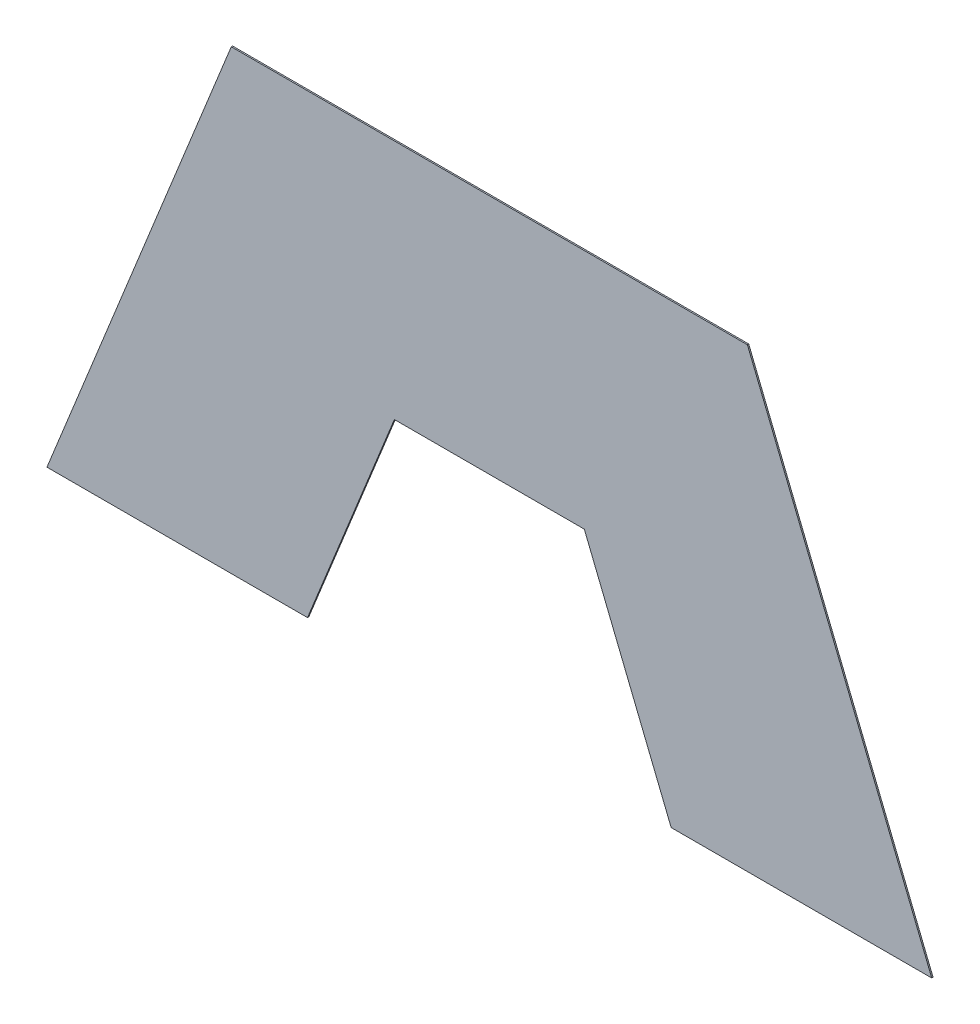
ISO-10303-21;
HEADER;
FILE_DESCRIPTION(('STEP AP214'),'2;1');
FILE_NAME('part.step','',(''),(''),'','','');
FILE_SCHEMA(('AUTOMOTIVE_DESIGN { 1 0 10303 214 1 1 1 1 }'));
ENDSEC;
DATA;
#1=APPLICATION_CONTEXT('core data for automotive mechanical design processes');
#2=APPLICATION_PROTOCOL_DEFINITION('international standard','automotive_design',2000,#1);
#3=PRODUCT_CONTEXT('',#1,'mechanical');
#4=PRODUCT('Part','Part','',(#3));
#5=PRODUCT_RELATED_PRODUCT_CATEGORY('part','',(#4));
#6=PRODUCT_DEFINITION_FORMATION('','',#4);
#7=PRODUCT_DEFINITION_CONTEXT('part definition',#1,'design');
#8=PRODUCT_DEFINITION('design','',#6,#7);
#9=PRODUCT_DEFINITION_SHAPE('','',#8);
#10=(LENGTH_UNIT() NAMED_UNIT(*) SI_UNIT(.MILLI.,.METRE.));
#11=(NAMED_UNIT(*) PLANE_ANGLE_UNIT() SI_UNIT($,.RADIAN.));
#12=(NAMED_UNIT(*) SI_UNIT($,.STERADIAN.) SOLID_ANGLE_UNIT());
#13=UNCERTAINTY_MEASURE_WITH_UNIT(LENGTH_MEASURE(1.E-05),#10,'distance_accuracy_value','');
#14=(GEOMETRIC_REPRESENTATION_CONTEXT(3) GLOBAL_UNCERTAINTY_ASSIGNED_CONTEXT((#13)) GLOBAL_UNIT_ASSIGNED_CONTEXT((#10,
#11,#12)) REPRESENTATION_CONTEXT('',''));
#15=CARTESIAN_POINT('',(0.,0.,0.));
#16=DIRECTION('',(0.,0.,1.));
#17=DIRECTION('',(1.,0.,0.));
#18=AXIS2_PLACEMENT_3D('',#15,#16,#17);
#19=CARTESIAN_POINT('',(0.40256545132415,-0.192580169588,0.0009));
#20=DIRECTION('',(0.,0.,-1.));
#21=DIRECTION('',(-1.,0.,0.));
#22=AXIS2_PLACEMENT_3D('',#19,#20,#21);
#23=PLANE('',#22);
#24=DIRECTION('',(-1.,0.,0.));
#25=VECTOR('',#24,1.);
#26=CARTESIAN_POINT('',(0.3888735877747,-0.192580169588,0.0009));
#27=LINE('',#26,#25);
#28=CARTESIAN_POINT('',(0.3888735877747,-0.192580169588,0.0009));
#29=VERTEX_POINT('',#28);
#30=CARTESIAN_POINT('',(0.3692535877747,-0.192580169588,0.0009));
#31=VERTEX_POINT('',#30);
#32=EDGE_CURVE('E11',#29,#31,#27,.T.);
#33=ORIENTED_EDGE('',*,*,#32,.T.);
#34=DIRECTION('',(0.374606593414237,0.927183854567464,0.));
#35=VECTOR('',#34,1.);
#36=CARTESIAN_POINT('',(0.3692535877747,-0.192580169588,0.0009));
#37=LINE('',#36,#35);
#38=CARTESIAN_POINT('',(0.3831340270567,-0.1582248768013,0.0009));
#39=VERTEX_POINT('',#38);
#40=EDGE_CURVE('E24',#31,#39,#37,.T.);
#41=ORIENTED_EDGE('',*,*,#40,.T.);
#42=DIRECTION('',(1.,0.,0.));
#43=VECTOR('',#42,1.);
#44=CARTESIAN_POINT('',(0.3831340270567,-0.1582248768013,0.0009));
#45=LINE('',#44,#43);
#46=CARTESIAN_POINT('',(0.4219968755916,-0.1582248768013,0.0009));
#47=VERTEX_POINT('',#46);
#48=EDGE_CURVE('E94',#39,#47,#45,.T.);
#49=ORIENTED_EDGE('',*,*,#48,.T.);
#50=DIRECTION('',(0.374606593414238,-0.927183854567464,0.));
#51=VECTOR('',#50,1.);
#52=CARTESIAN_POINT('',(0.4219968755916,-0.1582248768013,0.0009));
#53=LINE('',#52,#51);
#54=CARTESIAN_POINT('',(0.4358773148736,-0.192580169588,0.0009));
#55=VERTEX_POINT('',#54);
#56=EDGE_CURVE('E138',#47,#55,#53,.T.);
#57=ORIENTED_EDGE('',*,*,#56,.T.);
#58=DIRECTION('',(-1.,0.,0.));
#59=VECTOR('',#58,1.);
#60=CARTESIAN_POINT('',(0.4358773148736,-0.192580169588,0.0009));
#61=LINE('',#60,#59);
#62=CARTESIAN_POINT('',(0.4162573148736,-0.192580169588,0.0009));
#63=VERTEX_POINT('',#62);
#64=EDGE_CURVE('E136',#55,#63,#61,.T.);
#65=ORIENTED_EDGE('',*,*,#64,.T.);
#66=DIRECTION('',(-0.374606593419784,0.927183854565223,0.));
#67=VECTOR('',#66,1.);
#68=CARTESIAN_POINT('',(0.4162573148737,-0.192580169588,0.0009));
#69=LINE('',#68,#67);
#70=CARTESIAN_POINT('',(0.4097162071795,-0.1763903599275,0.0009));
#71=VERTEX_POINT('',#70);
#72=EDGE_CURVE('E134',#63,#71,#69,.T.);
#73=ORIENTED_EDGE('',*,*,#72,.T.);
#74=DIRECTION('',(-1.,0.,0.));
#75=VECTOR('',#74,1.);
#76=CARTESIAN_POINT('',(0.4097162071795,-0.1763903599275,0.0009));
#77=LINE('',#76,#75);
#78=CARTESIAN_POINT('',(0.3954146954688,-0.1763903599275,0.0009));
#79=VERTEX_POINT('',#78);
#80=EDGE_CURVE('E132',#71,#79,#77,.T.);
#81=ORIENTED_EDGE('',*,*,#80,.T.);
#82=DIRECTION('',(-0.374606593414859,-0.927183854567213,0.));
#83=VECTOR('',#82,1.);
#84=CARTESIAN_POINT('',(0.3954146954688,-0.1763903599275,0.0009));
#85=LINE('',#84,#83);
#86=EDGE_CURVE('E130',#79,#29,#85,.T.);
#87=ORIENTED_EDGE('',*,*,#86,.T.);
#88=EDGE_LOOP('',(#33,#41,#49,#57,#65,#73,#81,#87));
#89=FACE_BOUND('',#88,.T.);
#90=ADVANCED_FACE('F17',(#89),#23,.T.);
#91=CARTESIAN_POINT('',(0.3790635877747,-0.192580169588,0.0009));
#92=DIRECTION('',(0.,-1.,0.));
#93=DIRECTION('',(0.,0.,-1.));
#94=AXIS2_PLACEMENT_3D('',#91,#92,#93);
#95=PLANE('',#94);
#96=DIRECTION('',(1.,0.,0.));
#97=VECTOR('',#96,1.);
#98=CARTESIAN_POINT('',(0.3692535877747,-0.192580169588,0.001));
#99=LINE('',#98,#97);
#100=CARTESIAN_POINT('',(0.3692535877747,-0.192580169588,0.001));
#101=VERTEX_POINT('',#100);
#102=CARTESIAN_POINT('',(0.3888735877747,-0.192580169588,0.001));
#103=VERTEX_POINT('',#102);
#104=EDGE_CURVE('E128',#101,#103,#99,.T.);
#105=ORIENTED_EDGE('',*,*,#104,.F.);
#106=DIRECTION('',(0.,0.,-1.));
#107=VECTOR('',#106,1.);
#108=CARTESIAN_POINT('',(0.3692535877747,-0.192580169588,0.001));
#109=LINE('',#108,#107);
#110=EDGE_CURVE('E99',#101,#31,#109,.T.);
#111=ORIENTED_EDGE('',*,*,#110,.T.);
#112=ORIENTED_EDGE('',*,*,#32,.F.);
#113=DIRECTION('',(0.,0.,-1.));
#114=VECTOR('',#113,1.);
#115=CARTESIAN_POINT('',(0.3888735877747,-0.192580169588,0.001));
#116=LINE('',#115,#114);
#117=EDGE_CURVE('E124',#103,#29,#116,.T.);
#118=ORIENTED_EDGE('',*,*,#117,.F.);
#119=EDGE_LOOP('',(#105,#111,#112,#118));
#120=FACE_BOUND('',#119,.T.);
#121=ADVANCED_FACE('F141',(#120),#95,.T.);
#122=CARTESIAN_POINT('',(0.39214414162175,-0.18448526475775,0.0009));
#123=DIRECTION('',(0.927183854567213,-0.374606593414859,0.));
#124=DIRECTION('',(0.,0.,-1.));
#125=AXIS2_PLACEMENT_3D('',#122,#123,#124);
#126=PLANE('',#125);
#127=DIRECTION('',(0.374606593414859,0.927183854567213,0.));
#128=VECTOR('',#127,1.);
#129=CARTESIAN_POINT('',(0.3888735877747,-0.192580169588,0.001));
#130=LINE('',#129,#128);
#131=CARTESIAN_POINT('',(0.3954146954688,-0.1763903599275,0.001));
#132=VERTEX_POINT('',#131);
#133=EDGE_CURVE('E122',#103,#132,#130,.T.);
#134=ORIENTED_EDGE('',*,*,#133,.F.);
#135=ORIENTED_EDGE('',*,*,#117,.T.);
#136=ORIENTED_EDGE('',*,*,#86,.F.);
#137=DIRECTION('',(0.,0.,-1.));
#138=VECTOR('',#137,1.);
#139=CARTESIAN_POINT('',(0.3954146954688,-0.1763903599275,0.001));
#140=LINE('',#139,#138);
#141=EDGE_CURVE('E119',#132,#79,#140,.T.);
#142=ORIENTED_EDGE('',*,*,#141,.F.);
#143=EDGE_LOOP('',(#134,#135,#136,#142));
#144=FACE_BOUND('',#143,.T.);
#145=ADVANCED_FACE('F148',(#144),#126,.T.);
#146=CARTESIAN_POINT('',(0.40256545132415,-0.1763903599275,0.0009));
#147=DIRECTION('',(0.,-1.,0.));
#148=DIRECTION('',(0.,0.,-1.));
#149=AXIS2_PLACEMENT_3D('',#146,#147,#148);
#150=PLANE('',#149);
#151=DIRECTION('',(1.,0.,0.));
#152=VECTOR('',#151,1.);
#153=CARTESIAN_POINT('',(0.3954146954688,-0.1763903599275,0.001));
#154=LINE('',#153,#152);
#155=CARTESIAN_POINT('',(0.4097162071795,-0.1763903599275,0.001));
#156=VERTEX_POINT('',#155);
#157=EDGE_CURVE('E117',#132,#156,#154,.T.);
#158=ORIENTED_EDGE('',*,*,#157,.F.);
#159=ORIENTED_EDGE('',*,*,#141,.T.);
#160=ORIENTED_EDGE('',*,*,#80,.F.);
#161=DIRECTION('',(0.,0.,-1.));
#162=VECTOR('',#161,1.);
#163=CARTESIAN_POINT('',(0.4097162071795,-0.1763903599275,0.001));
#164=LINE('',#163,#162);
#165=EDGE_CURVE('E114',#156,#71,#164,.T.);
#166=ORIENTED_EDGE('',*,*,#165,.F.);
#167=EDGE_LOOP('',(#158,#159,#160,#166));
#168=FACE_BOUND('',#167,.T.);
#169=ADVANCED_FACE('F151',(#168),#150,.T.);
#170=CARTESIAN_POINT('',(0.4129867610266,-0.18448526475775,0.0009));
#171=DIRECTION('',(-0.927183854565223,-0.374606593419784,0.));
#172=DIRECTION('',(0.,0.,1.));
#173=AXIS2_PLACEMENT_3D('',#170,#171,#172);
#174=PLANE('',#173);
#175=DIRECTION('',(0.374606593419784,-0.927183854565223,0.));
#176=VECTOR('',#175,1.);
#177=CARTESIAN_POINT('',(0.4097162071795,-0.1763903599275,0.001));
#178=LINE('',#177,#176);
#179=CARTESIAN_POINT('',(0.4162573148736,-0.192580169588,0.001));
#180=VERTEX_POINT('',#179);
#181=EDGE_CURVE('E112',#156,#180,#178,.T.);
#182=ORIENTED_EDGE('',*,*,#181,.F.);
#183=ORIENTED_EDGE('',*,*,#165,.T.);
#184=ORIENTED_EDGE('',*,*,#72,.F.);
#185=DIRECTION('',(0.,0.,-1.));
#186=VECTOR('',#185,1.);
#187=CARTESIAN_POINT('',(0.4162573148736,-0.192580169588,0.001));
#188=LINE('',#187,#186);
#189=EDGE_CURVE('E109',#180,#63,#188,.T.);
#190=ORIENTED_EDGE('',*,*,#189,.F.);
#191=EDGE_LOOP('',(#182,#183,#184,#190));
#192=FACE_BOUND('',#191,.T.);
#193=ADVANCED_FACE('F156',(#192),#174,.T.);
#194=CARTESIAN_POINT('',(0.4260673148736,-0.192580169588,0.0009));
#195=DIRECTION('',(0.,-1.,0.));
#196=DIRECTION('',(0.,0.,-1.));
#197=AXIS2_PLACEMENT_3D('',#194,#195,#196);
#198=PLANE('',#197);
#199=DIRECTION('',(1.,0.,0.));
#200=VECTOR('',#199,1.);
#201=CARTESIAN_POINT('',(0.4162573148736,-0.192580169588,0.001));
#202=LINE('',#201,#200);
#203=CARTESIAN_POINT('',(0.4358773148736,-0.192580169588,0.001));
#204=VERTEX_POINT('',#203);
#205=EDGE_CURVE('E107',#180,#204,#202,.T.);
#206=ORIENTED_EDGE('',*,*,#205,.F.);
#207=ORIENTED_EDGE('',*,*,#189,.T.);
#208=ORIENTED_EDGE('',*,*,#64,.F.);
#209=DIRECTION('',(0.,0.,-1.));
#210=VECTOR('',#209,1.);
#211=CARTESIAN_POINT('',(0.4358773148736,-0.192580169588,0.001));
#212=LINE('',#211,#210);
#213=EDGE_CURVE('E104',#204,#55,#212,.T.);
#214=ORIENTED_EDGE('',*,*,#213,.F.);
#215=EDGE_LOOP('',(#206,#207,#208,#214));
#216=FACE_BOUND('',#215,.T.);
#217=ADVANCED_FACE('F161',(#216),#198,.T.);
#218=CARTESIAN_POINT('',(0.4289370952326,-0.17540252319465,0.0009));
#219=DIRECTION('',(0.927183854567464,0.374606593414238,0.));
#220=DIRECTION('',(0.,0.,-1.));
#221=AXIS2_PLACEMENT_3D('',#218,#219,#220);
#222=PLANE('',#221);
#223=DIRECTION('',(-0.374606593414238,0.927183854567464,0.));
#224=VECTOR('',#223,1.);
#225=CARTESIAN_POINT('',(0.4358773148736,-0.192580169588,0.001));
#226=LINE('',#225,#224);
#227=CARTESIAN_POINT('',(0.4219968755916,-0.1582248768013,0.001));
#228=VERTEX_POINT('',#227);
#229=EDGE_CURVE('E84',#204,#228,#226,.T.);
#230=ORIENTED_EDGE('',*,*,#229,.F.);
#231=ORIENTED_EDGE('',*,*,#213,.T.);
#232=ORIENTED_EDGE('',*,*,#56,.F.);
#233=DIRECTION('',(0.,0.,-1.));
#234=VECTOR('',#233,1.);
#235=CARTESIAN_POINT('',(0.4219968755916,-0.1582248768013,0.001));
#236=LINE('',#235,#234);
#237=EDGE_CURVE('E88',#228,#47,#236,.T.);
#238=ORIENTED_EDGE('',*,*,#237,.F.);
#239=EDGE_LOOP('',(#230,#231,#232,#238));
#240=FACE_BOUND('',#239,.T.);
#241=ADVANCED_FACE('F163',(#240),#222,.T.);
#242=CARTESIAN_POINT('',(0.40256545132415,-0.1582248768013,0.0009));
#243=DIRECTION('',(0.,1.,0.));
#244=DIRECTION('',(0.,0.,1.));
#245=AXIS2_PLACEMENT_3D('',#242,#243,#244);
#246=PLANE('',#245);
#247=DIRECTION('',(-1.,0.,0.));
#248=VECTOR('',#247,1.);
#249=CARTESIAN_POINT('',(0.4219968755916,-0.1582248768013,0.001));
#250=LINE('',#249,#248);
#251=CARTESIAN_POINT('',(0.3831340270567,-0.1582248768013,0.001));
#252=VERTEX_POINT('',#251);
#253=EDGE_CURVE('E78',#228,#252,#250,.T.);
#254=ORIENTED_EDGE('',*,*,#253,.F.);
#255=ORIENTED_EDGE('',*,*,#237,.T.);
#256=ORIENTED_EDGE('',*,*,#48,.F.);
#257=DIRECTION('',(0.,0.,-1.));
#258=VECTOR('',#257,1.);
#259=CARTESIAN_POINT('',(0.3831340270567,-0.1582248768013,0.001));
#260=LINE('',#259,#258);
#261=EDGE_CURVE('E89',#252,#39,#260,.T.);
#262=ORIENTED_EDGE('',*,*,#261,.F.);
#263=EDGE_LOOP('',(#254,#255,#256,#262));
#264=FACE_BOUND('',#263,.T.);
#265=ADVANCED_FACE('F93',(#264),#246,.T.);
#266=CARTESIAN_POINT('',(0.3761938074157,-0.17540252319465,0.0009));
#267=DIRECTION('',(-0.927183854567464,0.374606593414237,0.));
#268=DIRECTION('',(0.,0.,1.));
#269=AXIS2_PLACEMENT_3D('',#266,#267,#268);
#270=PLANE('',#269);
#271=DIRECTION('',(-0.374606593414237,-0.927183854567464,0.));
#272=VECTOR('',#271,1.);
#273=CARTESIAN_POINT('',(0.3831340270567,-0.1582248768013,0.001));
#274=LINE('',#273,#272);
#275=EDGE_CURVE('E82',#252,#101,#274,.T.);
#276=ORIENTED_EDGE('',*,*,#275,.F.);
#277=ORIENTED_EDGE('',*,*,#261,.T.);
#278=ORIENTED_EDGE('',*,*,#40,.F.);
#279=ORIENTED_EDGE('',*,*,#110,.F.);
#280=EDGE_LOOP('',(#276,#277,#278,#279));
#281=FACE_BOUND('',#280,.T.);
#282=ADVANCED_FACE('F98',(#281),#270,.T.);
#283=CARTESIAN_POINT('',(0.40256545132415,-0.192580169588,0.001));
#284=DIRECTION('',(0.,0.,-1.));
#285=DIRECTION('',(-1.,0.,0.));
#286=AXIS2_PLACEMENT_3D('',#283,#284,#285);
#287=PLANE('',#286);
#288=ORIENTED_EDGE('',*,*,#253,.T.);
#289=ORIENTED_EDGE('',*,*,#275,.T.);
#290=ORIENTED_EDGE('',*,*,#104,.T.);
#291=ORIENTED_EDGE('',*,*,#133,.T.);
#292=ORIENTED_EDGE('',*,*,#157,.T.);
#293=ORIENTED_EDGE('',*,*,#181,.T.);
#294=ORIENTED_EDGE('',*,*,#205,.T.);
#295=ORIENTED_EDGE('',*,*,#229,.T.);
#296=EDGE_LOOP('',(#288,#289,#290,#291,#292,#293,#294,#295));
#297=FACE_BOUND('',#296,.T.);
#298=ADVANCED_FACE('F80',(#297),#287,.F.);
#299=CLOSED_SHELL('',(#90,#121,#145,#169,#193,#217,#241,#265,#282,#298));
#300=MANIFOLD_SOLID_BREP('B1',#299);
#301=ADVANCED_BREP_SHAPE_REPRESENTATION('',(#18,#300),#14);
#302=SHAPE_DEFINITION_REPRESENTATION(#9,#301);
ENDSEC;
END-ISO-10303-21;
